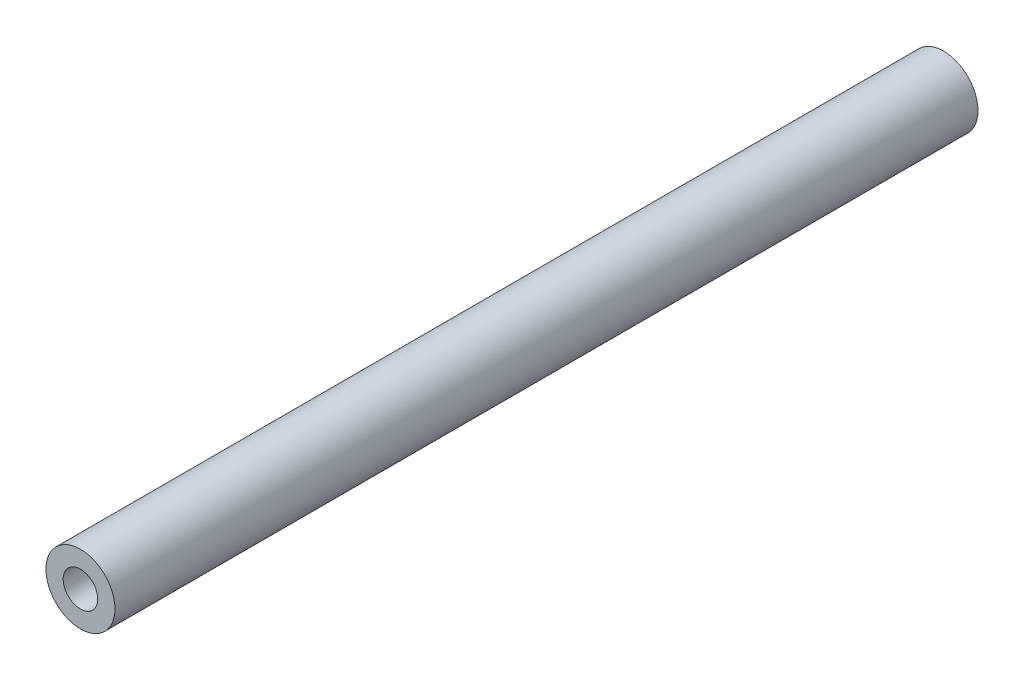
ISO-10303-21;
HEADER;
FILE_DESCRIPTION(('STEP AP214'),'2;1');
FILE_NAME('part.step','',(''),(''),'','','');
FILE_SCHEMA(('AUTOMOTIVE_DESIGN { 1 0 10303 214 1 1 1 1 }'));
ENDSEC;
DATA;
#1=APPLICATION_CONTEXT('core data for automotive mechanical design processes');
#2=APPLICATION_PROTOCOL_DEFINITION('international standard','automotive_design',2000,#1);
#3=PRODUCT_CONTEXT('',#1,'mechanical');
#4=PRODUCT('Part','Part','',(#3));
#5=PRODUCT_RELATED_PRODUCT_CATEGORY('part','',(#4));
#6=PRODUCT_DEFINITION_FORMATION('','',#4);
#7=PRODUCT_DEFINITION_CONTEXT('part definition',#1,'design');
#8=PRODUCT_DEFINITION('design','',#6,#7);
#9=PRODUCT_DEFINITION_SHAPE('','',#8);
#10=(LENGTH_UNIT() NAMED_UNIT(*) SI_UNIT(.MILLI.,.METRE.));
#11=(NAMED_UNIT(*) PLANE_ANGLE_UNIT() SI_UNIT($,.RADIAN.));
#12=(NAMED_UNIT(*) SI_UNIT($,.STERADIAN.) SOLID_ANGLE_UNIT());
#13=UNCERTAINTY_MEASURE_WITH_UNIT(LENGTH_MEASURE(1.E-05),#10,'distance_accuracy_value','');
#14=(GEOMETRIC_REPRESENTATION_CONTEXT(3) GLOBAL_UNCERTAINTY_ASSIGNED_CONTEXT((#13)) GLOBAL_UNIT_ASSIGNED_CONTEXT((#10,
#11,#12)) REPRESENTATION_CONTEXT('',''));
#15=CARTESIAN_POINT('',(0.,0.,0.));
#16=DIRECTION('',(0.,0.,1.));
#17=DIRECTION('',(1.,0.,0.));
#18=AXIS2_PLACEMENT_3D('',#15,#16,#17);
#19=CARTESIAN_POINT('',(0.,2.65361902941724,100.));
#20=DIRECTION('',(0.,0.,-1.));
#21=DIRECTION('',(-1.,0.,0.));
#22=AXIS2_PLACEMENT_3D('',#19,#20,#21);
#23=CYLINDRICAL_SURFACE('',#22,2.);
#24=CARTESIAN_POINT('',(0.,2.65361902941724,100.));
#25=DIRECTION('',(0.,0.,1.));
#26=DIRECTION('',(1.,0.,0.));
#27=AXIS2_PLACEMENT_3D('',#24,#25,#26);
#28=CIRCLE('',#27,2.);
#29=CARTESIAN_POINT('',(2.,2.65361902941724,100.));
#30=VERTEX_POINT('',#29);
#31=EDGE_CURVE('E69',#30,#30,#28,.T.);
#32=ORIENTED_EDGE('',*,*,#31,.T.);
#33=EDGE_LOOP('',(#32));
#34=FACE_BOUND('',#33,.T.);
#35=CARTESIAN_POINT('',(0.,2.65361902941724,0.));
#36=DIRECTION('',(0.,0.,1.));
#37=DIRECTION('',(1.,0.,0.));
#38=AXIS2_PLACEMENT_3D('',#35,#36,#37);
#39=CIRCLE('',#38,2.);
#40=CARTESIAN_POINT('',(2.,2.65361902941724,0.));
#41=VERTEX_POINT('',#40);
#42=EDGE_CURVE('E76',#41,#41,#39,.T.);
#43=ORIENTED_EDGE('',*,*,#42,.F.);
#44=EDGE_LOOP('',(#43));
#45=FACE_BOUND('',#44,.T.);
#46=ADVANCED_FACE('F61',(#34,#45),#23,.F.);
#47=CARTESIAN_POINT('',(0.,0.,0.));
#48=DIRECTION('',(0.,0.,1.));
#49=DIRECTION('',(1.,0.,0.));
#50=AXIS2_PLACEMENT_3D('',#47,#48,#49);
#51=PLANE('',#50);
#52=ORIENTED_EDGE('',*,*,#42,.T.);
#53=EDGE_LOOP('',(#52));
#54=FACE_BOUND('',#53,.T.);
#55=CARTESIAN_POINT('',(0.,2.65361902941724,0.));
#56=DIRECTION('',(0.,0.,1.));
#57=DIRECTION('',(1.,0.,0.));
#58=AXIS2_PLACEMENT_3D('',#55,#56,#57);
#59=CIRCLE('',#58,4.);
#60=CARTESIAN_POINT('',(4.,2.65361902941724,0.));
#61=VERTEX_POINT('',#60);
#62=EDGE_CURVE('E64',#61,#61,#59,.T.);
#63=ORIENTED_EDGE('',*,*,#62,.F.);
#64=EDGE_LOOP('',(#63));
#65=FACE_BOUND('',#64,.T.);
#66=ADVANCED_FACE('F87',(#54,#65),#51,.F.);
#67=CARTESIAN_POINT('',(0.,2.65361902941724,100.));
#68=DIRECTION('',(0.,0.,-1.));
#69=DIRECTION('',(-1.,0.,0.));
#70=AXIS2_PLACEMENT_3D('',#67,#68,#69);
#71=CYLINDRICAL_SURFACE('',#70,4.);
#72=CARTESIAN_POINT('',(0.,2.65361902941724,100.));
#73=DIRECTION('',(0.,0.,1.));
#74=DIRECTION('',(1.,0.,0.));
#75=AXIS2_PLACEMENT_3D('',#72,#73,#74);
#76=CIRCLE('',#75,4.);
#77=CARTESIAN_POINT('',(4.,2.65361902941724,100.));
#78=VERTEX_POINT('',#77);
#79=EDGE_CURVE('E11',#78,#78,#76,.T.);
#80=ORIENTED_EDGE('',*,*,#79,.F.);
#81=EDGE_LOOP('',(#80));
#82=FACE_BOUND('',#81,.T.);
#83=ORIENTED_EDGE('',*,*,#62,.T.);
#84=EDGE_LOOP('',(#83));
#85=FACE_BOUND('',#84,.T.);
#86=ADVANCED_FACE('F85',(#82,#85),#71,.T.);
#87=CARTESIAN_POINT('',(0.,0.,100.));
#88=DIRECTION('',(0.,0.,1.));
#89=DIRECTION('',(1.,0.,0.));
#90=AXIS2_PLACEMENT_3D('',#87,#88,#89);
#91=PLANE('',#90);
#92=ORIENTED_EDGE('',*,*,#31,.F.);
#93=EDGE_LOOP('',(#92));
#94=FACE_BOUND('',#93,.T.);
#95=ORIENTED_EDGE('',*,*,#79,.T.);
#96=EDGE_LOOP('',(#95));
#97=FACE_BOUND('',#96,.T.);
#98=ADVANCED_FACE('F94',(#94,#97),#91,.T.);
#99=CLOSED_SHELL('',(#46,#66,#86,#98));
#100=MANIFOLD_SOLID_BREP('B2',#99);
#101=ADVANCED_BREP_SHAPE_REPRESENTATION('',(#18,#100),#14);
#102=SHAPE_DEFINITION_REPRESENTATION(#9,#101);
ENDSEC;
END-ISO-10303-21;
